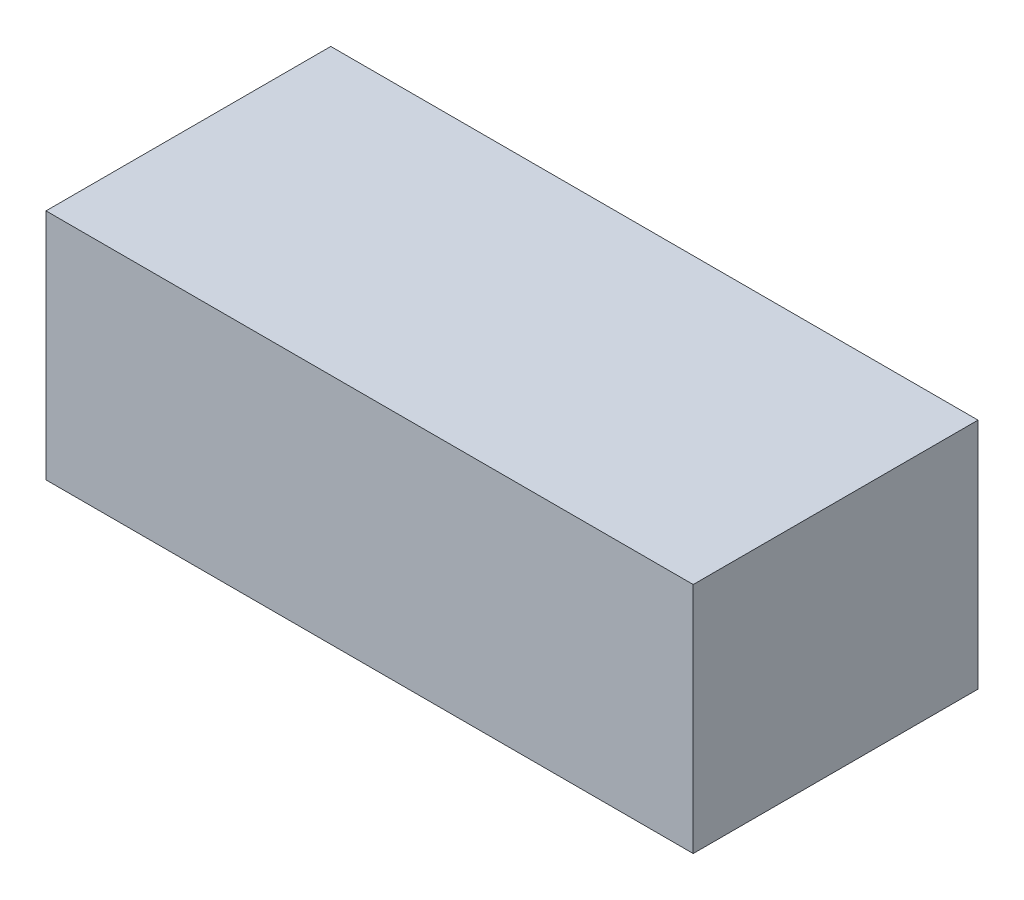
ISO-10303-21;
HEADER;
FILE_DESCRIPTION(('STEP AP214'),'2;1');
FILE_NAME('part.step','',(''),(''),'','','');
FILE_SCHEMA(('AUTOMOTIVE_DESIGN { 1 0 10303 214 1 1 1 1 }'));
ENDSEC;
DATA;
#1=APPLICATION_CONTEXT('core data for automotive mechanical design processes');
#2=APPLICATION_PROTOCOL_DEFINITION('international standard','automotive_design',2000,#1);
#3=PRODUCT_CONTEXT('',#1,'mechanical');
#4=PRODUCT('Part','Part','',(#3));
#5=PRODUCT_RELATED_PRODUCT_CATEGORY('part','',(#4));
#6=PRODUCT_DEFINITION_FORMATION('','',#4);
#7=PRODUCT_DEFINITION_CONTEXT('part definition',#1,'design');
#8=PRODUCT_DEFINITION('design','',#6,#7);
#9=PRODUCT_DEFINITION_SHAPE('','',#8);
#10=(LENGTH_UNIT() NAMED_UNIT(*) SI_UNIT(.MILLI.,.METRE.));
#11=(NAMED_UNIT(*) PLANE_ANGLE_UNIT() SI_UNIT($,.RADIAN.));
#12=(NAMED_UNIT(*) SI_UNIT($,.STERADIAN.) SOLID_ANGLE_UNIT());
#13=UNCERTAINTY_MEASURE_WITH_UNIT(LENGTH_MEASURE(1.E-05),#10,'distance_accuracy_value','');
#14=(GEOMETRIC_REPRESENTATION_CONTEXT(3) GLOBAL_UNCERTAINTY_ASSIGNED_CONTEXT((#13)) GLOBAL_UNIT_ASSIGNED_CONTEXT((#10,
#11,#12)) REPRESENTATION_CONTEXT('',''));
#15=CARTESIAN_POINT('',(0.,0.,0.));
#16=DIRECTION('',(0.,0.,1.));
#17=DIRECTION('',(1.,0.,0.));
#18=AXIS2_PLACEMENT_3D('',#15,#16,#17);
#19=CARTESIAN_POINT('',(-1.25000004,-0.4499991,1.10000034));
#20=DIRECTION('',(0.,0.,1.));
#21=DIRECTION('',(1.,0.,0.));
#22=AXIS2_PLACEMENT_3D('',#19,#20,#21);
#23=PLANE('',#22);
#24=DIRECTION('',(-1.,0.,0.));
#25=VECTOR('',#24,1.);
#26=CARTESIAN_POINT('',(1.25000004,-0.4499991,1.10000034));
#27=LINE('',#26,#25);
#28=CARTESIAN_POINT('',(1.25000004,-0.4499991,1.10000034));
#29=VERTEX_POINT('',#28);
#30=CARTESIAN_POINT('',(-1.25000004,-0.4499991,1.10000034));
#31=VERTEX_POINT('',#30);
#32=EDGE_CURVE('E26',#29,#31,#27,.T.);
#33=ORIENTED_EDGE('',*,*,#32,.F.);
#34=DIRECTION('',(0.,-1.,0.));
#35=VECTOR('',#34,1.);
#36=CARTESIAN_POINT('',(1.25000004,0.45000164,1.10000034));
#37=LINE('',#36,#35);
#38=CARTESIAN_POINT('',(1.25000004,0.45000164,1.10000034));
#39=VERTEX_POINT('',#38);
#40=EDGE_CURVE('E58',#39,#29,#37,.T.);
#41=ORIENTED_EDGE('',*,*,#40,.F.);
#42=DIRECTION('',(1.,0.,0.));
#43=VECTOR('',#42,1.);
#44=CARTESIAN_POINT('',(-1.25000004,0.45000164,1.10000034));
#45=LINE('',#44,#43);
#46=CARTESIAN_POINT('',(-1.25000004,0.45000164,1.10000034));
#47=VERTEX_POINT('',#46);
#48=EDGE_CURVE('E90',#47,#39,#45,.T.);
#49=ORIENTED_EDGE('',*,*,#48,.F.);
#50=DIRECTION('',(0.,1.,0.));
#51=VECTOR('',#50,1.);
#52=CARTESIAN_POINT('',(-1.25000004,-0.4499991,1.10000034));
#53=LINE('',#52,#51);
#54=EDGE_CURVE('E95',#31,#47,#53,.T.);
#55=ORIENTED_EDGE('',*,*,#54,.F.);
#56=EDGE_LOOP('',(#33,#41,#49,#55));
#57=FACE_BOUND('',#56,.T.);
#58=ADVANCED_FACE('F17',(#57),#23,.T.);
#59=CARTESIAN_POINT('',(-1.25000004,-0.4499991,0.));
#60=DIRECTION('',(0.,0.,1.));
#61=DIRECTION('',(1.,0.,0.));
#62=AXIS2_PLACEMENT_3D('',#59,#60,#61);
#63=PLANE('',#62);
#64=DIRECTION('',(0.,1.,0.));
#65=VECTOR('',#64,1.);
#66=CARTESIAN_POINT('',(-1.25000004,-0.4499991,0.));
#67=LINE('',#66,#65);
#68=CARTESIAN_POINT('',(-1.25000004,-0.4499991,0.));
#69=VERTEX_POINT('',#68);
#70=CARTESIAN_POINT('',(-1.25000004,0.45000164,0.));
#71=VERTEX_POINT('',#70);
#72=EDGE_CURVE('E81',#69,#71,#67,.T.);
#73=ORIENTED_EDGE('',*,*,#72,.T.);
#74=DIRECTION('',(1.,0.,0.));
#75=VECTOR('',#74,1.);
#76=CARTESIAN_POINT('',(-1.25000004,0.45000164,0.));
#77=LINE('',#76,#75);
#78=CARTESIAN_POINT('',(1.25000004,0.45000164,0.));
#79=VERTEX_POINT('',#78);
#80=EDGE_CURVE('E66',#71,#79,#77,.T.);
#81=ORIENTED_EDGE('',*,*,#80,.T.);
#82=DIRECTION('',(0.,-1.,0.));
#83=VECTOR('',#82,1.);
#84=CARTESIAN_POINT('',(1.25000004,0.45000164,0.));
#85=LINE('',#84,#83);
#86=CARTESIAN_POINT('',(1.25000004,-0.4499991,0.));
#87=VERTEX_POINT('',#86);
#88=EDGE_CURVE('E49',#79,#87,#85,.T.);
#89=ORIENTED_EDGE('',*,*,#88,.T.);
#90=DIRECTION('',(-1.,0.,0.));
#91=VECTOR('',#90,1.);
#92=CARTESIAN_POINT('',(1.25000004,-0.4499991,0.));
#93=LINE('',#92,#91);
#94=EDGE_CURVE('E11',#87,#69,#93,.T.);
#95=ORIENTED_EDGE('',*,*,#94,.T.);
#96=EDGE_LOOP('',(#73,#81,#89,#95));
#97=FACE_BOUND('',#96,.T.);
#98=ADVANCED_FACE('F80',(#97),#63,.F.);
#99=CARTESIAN_POINT('',(1.25000004,-0.4499991,0.));
#100=DIRECTION('',(0.,-1.,0.));
#101=DIRECTION('',(0.,0.,-1.));
#102=AXIS2_PLACEMENT_3D('',#99,#100,#101);
#103=PLANE('',#102);
#104=DIRECTION('',(0.,0.,1.));
#105=VECTOR('',#104,1.);
#106=CARTESIAN_POINT('',(1.25000004,-0.4499991,0.));
#107=LINE('',#106,#105);
#108=EDGE_CURVE('E107',#87,#29,#107,.T.);
#109=ORIENTED_EDGE('',*,*,#108,.T.);
#110=ORIENTED_EDGE('',*,*,#32,.T.);
#111=DIRECTION('',(0.,0.,1.));
#112=VECTOR('',#111,1.);
#113=CARTESIAN_POINT('',(-1.25000004,-0.4499991,0.));
#114=LINE('',#113,#112);
#115=EDGE_CURVE('E87',#69,#31,#114,.T.);
#116=ORIENTED_EDGE('',*,*,#115,.F.);
#117=ORIENTED_EDGE('',*,*,#94,.F.);
#118=EDGE_LOOP('',(#109,#110,#116,#117));
#119=FACE_BOUND('',#118,.T.);
#120=ADVANCED_FACE('F92',(#119),#103,.T.);
#121=CARTESIAN_POINT('',(1.25000004,0.45000164,0.));
#122=DIRECTION('',(1.,0.,0.));
#123=DIRECTION('',(0.,1.,0.));
#124=AXIS2_PLACEMENT_3D('',#121,#122,#123);
#125=PLANE('',#124);
#126=DIRECTION('',(0.,0.,1.));
#127=VECTOR('',#126,1.);
#128=CARTESIAN_POINT('',(1.25000004,0.45000164,0.));
#129=LINE('',#128,#127);
#130=EDGE_CURVE('E108',#79,#39,#129,.T.);
#131=ORIENTED_EDGE('',*,*,#130,.T.);
#132=ORIENTED_EDGE('',*,*,#40,.T.);
#133=ORIENTED_EDGE('',*,*,#108,.F.);
#134=ORIENTED_EDGE('',*,*,#88,.F.);
#135=EDGE_LOOP('',(#131,#132,#133,#134));
#136=FACE_BOUND('',#135,.T.);
#137=ADVANCED_FACE('F122',(#136),#125,.T.);
#138=CARTESIAN_POINT('',(-1.25000004,0.45000164,0.));
#139=DIRECTION('',(0.,1.,0.));
#140=DIRECTION('',(1.,0.,0.));
#141=AXIS2_PLACEMENT_3D('',#138,#139,#140);
#142=PLANE('',#141);
#143=DIRECTION('',(0.,0.,1.));
#144=VECTOR('',#143,1.);
#145=CARTESIAN_POINT('',(-1.25000004,0.45000164,0.));
#146=LINE('',#145,#144);
#147=EDGE_CURVE('E88',#71,#47,#146,.T.);
#148=ORIENTED_EDGE('',*,*,#147,.T.);
#149=ORIENTED_EDGE('',*,*,#48,.T.);
#150=ORIENTED_EDGE('',*,*,#130,.F.);
#151=ORIENTED_EDGE('',*,*,#80,.F.);
#152=EDGE_LOOP('',(#148,#149,#150,#151));
#153=FACE_BOUND('',#152,.T.);
#154=ADVANCED_FACE('F123',(#153),#142,.T.);
#155=CARTESIAN_POINT('',(-1.25000004,-0.4499991,0.));
#156=DIRECTION('',(-1.,0.,0.));
#157=DIRECTION('',(0.,0.,1.));
#158=AXIS2_PLACEMENT_3D('',#155,#156,#157);
#159=PLANE('',#158);
#160=ORIENTED_EDGE('',*,*,#115,.T.);
#161=ORIENTED_EDGE('',*,*,#54,.T.);
#162=ORIENTED_EDGE('',*,*,#147,.F.);
#163=ORIENTED_EDGE('',*,*,#72,.F.);
#164=EDGE_LOOP('',(#160,#161,#162,#163));
#165=FACE_BOUND('',#164,.T.);
#166=ADVANCED_FACE('F85',(#165),#159,.T.);
#167=CLOSED_SHELL('',(#58,#98,#120,#137,#154,#166));
#168=MANIFOLD_SOLID_BREP('B1',#167);
#169=ADVANCED_BREP_SHAPE_REPRESENTATION('',(#18,#168),#14);
#170=SHAPE_DEFINITION_REPRESENTATION(#9,#169);
ENDSEC;
END-ISO-10303-21;
